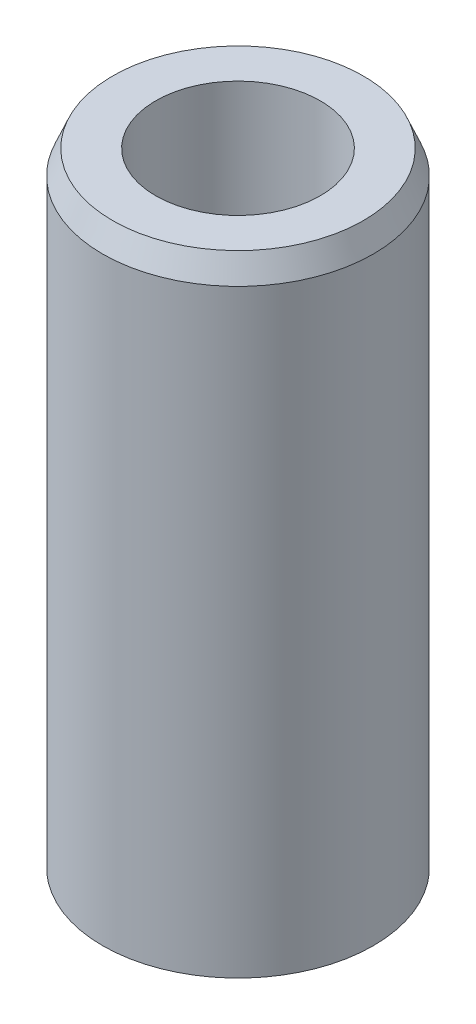
ISO-10303-21;
HEADER;
FILE_DESCRIPTION(('STEP AP214'),'2;1');
FILE_NAME('part.step','',(''),(''),'','','');
FILE_SCHEMA(('AUTOMOTIVE_DESIGN { 1 0 10303 214 1 1 1 1 }'));
ENDSEC;
DATA;
#1=APPLICATION_CONTEXT('core data for automotive mechanical design processes');
#2=APPLICATION_PROTOCOL_DEFINITION('international standard','automotive_design',2000,#1);
#3=PRODUCT_CONTEXT('',#1,'mechanical');
#4=PRODUCT('Part','Part','',(#3));
#5=PRODUCT_RELATED_PRODUCT_CATEGORY('part','',(#4));
#6=PRODUCT_DEFINITION_FORMATION('','',#4);
#7=PRODUCT_DEFINITION_CONTEXT('part definition',#1,'design');
#8=PRODUCT_DEFINITION('design','',#6,#7);
#9=PRODUCT_DEFINITION_SHAPE('','',#8);
#10=(LENGTH_UNIT() NAMED_UNIT(*) SI_UNIT(.MILLI.,.METRE.));
#11=(NAMED_UNIT(*) PLANE_ANGLE_UNIT() SI_UNIT($,.RADIAN.));
#12=(NAMED_UNIT(*) SI_UNIT($,.STERADIAN.) SOLID_ANGLE_UNIT());
#13=UNCERTAINTY_MEASURE_WITH_UNIT(LENGTH_MEASURE(1.E-05),#10,'distance_accuracy_value','');
#14=(GEOMETRIC_REPRESENTATION_CONTEXT(3) GLOBAL_UNCERTAINTY_ASSIGNED_CONTEXT((#13)) GLOBAL_UNIT_ASSIGNED_CONTEXT((#10,
#11,#12)) REPRESENTATION_CONTEXT('',''));
#15=CARTESIAN_POINT('',(0.,0.,0.));
#16=DIRECTION('',(0.,0.,1.));
#17=DIRECTION('',(1.,0.,0.));
#18=AXIS2_PLACEMENT_3D('',#15,#16,#17);
#19=CARTESIAN_POINT('',(0.,81.8250640471304,0.));
#20=DIRECTION('',(0.,-1.,0.));
#21=DIRECTION('',(0.,0.,-1.));
#22=AXIS2_PLACEMENT_3D('',#19,#20,#21);
#23=CYLINDRICAL_SURFACE('',#22,17.5);
#24=CARTESIAN_POINT('',(0.,78.7351680570615,0.));
#25=DIRECTION('',(0.,1.,0.));
#26=DIRECTION('',(0.,0.,1.));
#27=AXIS2_PLACEMENT_3D('',#24,#25,#26);
#28=CIRCLE('',#27,17.5);
#29=CARTESIAN_POINT('',(0.,78.7351680570615,17.5));
#30=VERTEX_POINT('',#29);
#31=EDGE_CURVE('E50',#30,#30,#28,.F.);
#32=ORIENTED_EDGE('',*,*,#31,.T.);
#33=EDGE_LOOP('',(#32));
#34=FACE_BOUND('',#33,.T.);
#35=CARTESIAN_POINT('',(0.,1.29673869480854,0.));
#36=DIRECTION('',(0.,1.,0.));
#37=DIRECTION('',(0.,0.,1.));
#38=AXIS2_PLACEMENT_3D('',#35,#36,#37);
#39=CIRCLE('',#38,17.5);
#40=CARTESIAN_POINT('',(0.,1.29673869480854,17.5));
#41=VERTEX_POINT('',#40);
#42=EDGE_CURVE('E51',#41,#41,#39,.T.);
#43=ORIENTED_EDGE('',*,*,#42,.T.);
#44=EDGE_LOOP('',(#43));
#45=FACE_BOUND('',#44,.T.);
#46=ADVANCED_FACE('F39',(#34,#45),#23,.T.);
#47=CARTESIAN_POINT('',(0.,81.8250640471304,0.));
#48=DIRECTION('',(0.,1.,0.));
#49=DIRECTION('',(0.,0.,1.));
#50=AXIS2_PLACEMENT_3D('',#47,#48,#49);
#51=PLANE('',#50);
#52=CARTESIAN_POINT('',(0.,81.8250640471304,0.));
#53=DIRECTION('',(0.,1.,0.));
#54=DIRECTION('',(0.,0.,1.));
#55=AXIS2_PLACEMENT_3D('',#52,#53,#54);
#56=CIRCLE('',#55,16.2032613051915);
#57=CARTESIAN_POINT('',(0.,81.8250640471304,16.2032613051915));
#58=VERTEX_POINT('',#57);
#59=EDGE_CURVE('E54',#58,#58,#56,.T.);
#60=ORIENTED_EDGE('',*,*,#59,.T.);
#61=EDGE_LOOP('',(#60));
#62=FACE_BOUND('',#61,.T.);
#63=CARTESIAN_POINT('',(0.,81.8250640471304,0.));
#64=DIRECTION('',(0.,1.,0.));
#65=DIRECTION('',(0.,0.,1.));
#66=AXIS2_PLACEMENT_3D('',#63,#64,#65);
#67=CIRCLE('',#66,10.6419325376186);
#68=CARTESIAN_POINT('',(0.,81.8250640471304,10.6419325376186));
#69=VERTEX_POINT('',#68);
#70=EDGE_CURVE('E58',#69,#69,#67,.T.);
#71=ORIENTED_EDGE('',*,*,#70,.F.);
#72=EDGE_LOOP('',(#71));
#73=FACE_BOUND('',#72,.T.);
#74=ADVANCED_FACE('F69',(#62,#73),#51,.T.);
#75=CARTESIAN_POINT('',(0.,0.,0.));
#76=DIRECTION('',(0.,1.,0.));
#77=DIRECTION('',(0.,0.,1.));
#78=AXIS2_PLACEMENT_3D('',#75,#76,#77);
#79=PLANE('',#78);
#80=CARTESIAN_POINT('',(0.,0.,0.));
#81=DIRECTION('',(0.,1.,0.));
#82=DIRECTION('',(0.,0.,1.));
#83=AXIS2_PLACEMENT_3D('',#80,#81,#82);
#84=CIRCLE('',#83,14.410104009931);
#85=CARTESIAN_POINT('',(0.,0.,14.410104009931));
#86=VERTEX_POINT('',#85);
#87=EDGE_CURVE('E10',#86,#86,#84,.F.);
#88=ORIENTED_EDGE('',*,*,#87,.T.);
#89=EDGE_LOOP('',(#88));
#90=FACE_BOUND('',#89,.T.);
#91=CARTESIAN_POINT('',(0.,0.,0.));
#92=DIRECTION('',(0.,1.,0.));
#93=DIRECTION('',(0.,0.,1.));
#94=AXIS2_PLACEMENT_3D('',#91,#92,#93);
#95=CIRCLE('',#94,10.6419325376186);
#96=CARTESIAN_POINT('',(0.,0.,10.6419325376186));
#97=VERTEX_POINT('',#96);
#98=EDGE_CURVE('E63',#97,#97,#95,.T.);
#99=ORIENTED_EDGE('',*,*,#98,.T.);
#100=EDGE_LOOP('',(#99));
#101=FACE_BOUND('',#100,.T.);
#102=ADVANCED_FACE('F75',(#90,#101),#79,.F.);
#103=CARTESIAN_POINT('',(0.,81.8250640471304,0.));
#104=DIRECTION('',(0.,-1.,0.));
#105=DIRECTION('',(0.,0.,-1.));
#106=AXIS2_PLACEMENT_3D('',#103,#104,#105);
#107=CYLINDRICAL_SURFACE('',#106,10.6419325376186);
#108=ORIENTED_EDGE('',*,*,#70,.T.);
#109=EDGE_LOOP('',(#108));
#110=FACE_BOUND('',#109,.T.);
#111=ORIENTED_EDGE('',*,*,#98,.F.);
#112=EDGE_LOOP('',(#111));
#113=FACE_BOUND('',#112,.T.);
#114=ADVANCED_FACE('F70',(#110,#113),#107,.F.);
#115=CARTESIAN_POINT('',(0.,81.8250640471304,0.));
#116=DIRECTION('',(0.,-1.,0.));
#117=DIRECTION('',(0.,0.,-1.));
#118=AXIS2_PLACEMENT_3D('',#115,#116,#117);
#119=CONICAL_SURFACE('',#118,16.2032613051915,0.39734800427589);
#120=ORIENTED_EDGE('',*,*,#31,.F.);
#121=EDGE_LOOP('',(#120));
#122=FACE_BOUND('',#121,.T.);
#123=ORIENTED_EDGE('',*,*,#59,.F.);
#124=EDGE_LOOP('',(#123));
#125=FACE_BOUND('',#124,.T.);
#126=ADVANCED_FACE('F81',(#122,#125),#119,.T.);
#127=CARTESIAN_POINT('',(0.,1.29673869480854,0.));
#128=DIRECTION('',(0.,1.,0.));
#129=DIRECTION('',(0.,0.,1.));
#130=AXIS2_PLACEMENT_3D('',#127,#128,#129);
#131=CONICAL_SURFACE('',#130,17.5,1.17344832251901);
#132=ORIENTED_EDGE('',*,*,#87,.F.);
#133=EDGE_LOOP('',(#132));
#134=FACE_BOUND('',#133,.T.);
#135=ORIENTED_EDGE('',*,*,#42,.F.);
#136=EDGE_LOOP('',(#135));
#137=FACE_BOUND('',#136,.T.);
#138=ADVANCED_FACE('F45',(#134,#137),#131,.T.);
#139=CLOSED_SHELL('',(#46,#74,#102,#114,#126,#138));
#140=MANIFOLD_SOLID_BREP('B2',#139);
#141=ADVANCED_BREP_SHAPE_REPRESENTATION('',(#18,#140),#14);
#142=SHAPE_DEFINITION_REPRESENTATION(#9,#141);
ENDSEC;
END-ISO-10303-21;
